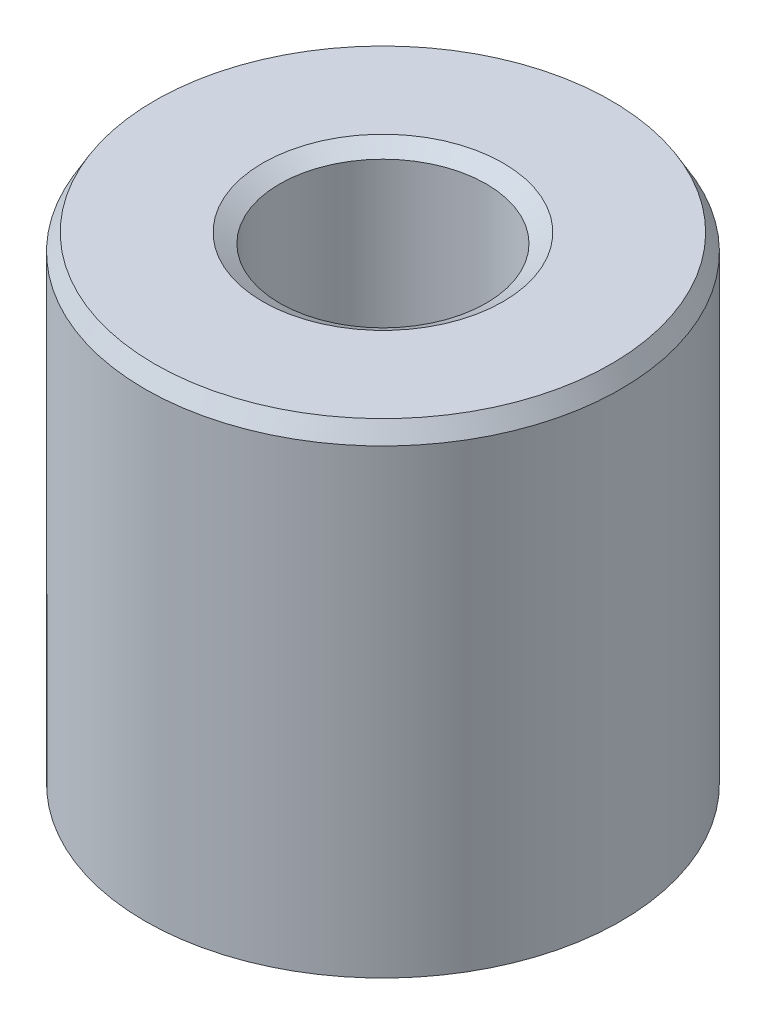
ISO-10303-21;
HEADER;
FILE_DESCRIPTION(('STEP AP214'),'2;1');
FILE_NAME('part.step','',(''),(''),'','','');
FILE_SCHEMA(('AUTOMOTIVE_DESIGN { 1 0 10303 214 1 1 1 1 }'));
ENDSEC;
DATA;
#1=APPLICATION_CONTEXT('core data for automotive mechanical design processes');
#2=APPLICATION_PROTOCOL_DEFINITION('international standard','automotive_design',2000,#1);
#3=PRODUCT_CONTEXT('',#1,'mechanical');
#4=PRODUCT('Part','Part','',(#3));
#5=PRODUCT_RELATED_PRODUCT_CATEGORY('part','',(#4));
#6=PRODUCT_DEFINITION_FORMATION('','',#4);
#7=PRODUCT_DEFINITION_CONTEXT('part definition',#1,'design');
#8=PRODUCT_DEFINITION('design','',#6,#7);
#9=PRODUCT_DEFINITION_SHAPE('','',#8);
#10=(LENGTH_UNIT() NAMED_UNIT(*) SI_UNIT(.MILLI.,.METRE.));
#11=(NAMED_UNIT(*) PLANE_ANGLE_UNIT() SI_UNIT($,.RADIAN.));
#12=(NAMED_UNIT(*) SI_UNIT($,.STERADIAN.) SOLID_ANGLE_UNIT());
#13=UNCERTAINTY_MEASURE_WITH_UNIT(LENGTH_MEASURE(1.E-05),#10,'distance_accuracy_value','');
#14=(GEOMETRIC_REPRESENTATION_CONTEXT(3) GLOBAL_UNCERTAINTY_ASSIGNED_CONTEXT((#13)) GLOBAL_UNIT_ASSIGNED_CONTEXT((#10,
#11,#12)) REPRESENTATION_CONTEXT('',''));
#15=CARTESIAN_POINT('',(0.,0.,0.));
#16=DIRECTION('',(0.,0.,1.));
#17=DIRECTION('',(1.,0.,0.));
#18=AXIS2_PLACEMENT_3D('',#15,#16,#17);
#19=CARTESIAN_POINT('',(0.,66.5699540929479,0.));
#20=DIRECTION('',(0.,-1.,0.));
#21=DIRECTION('',(0.,0.,-1.));
#22=AXIS2_PLACEMENT_3D('',#19,#20,#21);
#23=CYLINDRICAL_SURFACE('',#22,32.5);
#24=CARTESIAN_POINT('',(0.,1.32758882361556,0.));
#25=DIRECTION('',(0.,1.,0.));
#26=DIRECTION('',(0.,0.,1.));
#27=AXIS2_PLACEMENT_3D('',#24,#25,#26);
#28=CIRCLE('',#27,32.5);
#29=CARTESIAN_POINT('',(0.,1.32758882361556,32.5));
#30=VERTEX_POINT('',#29);
#31=EDGE_CURVE('E10',#30,#30,#28,.T.);
#32=ORIENTED_EDGE('',*,*,#31,.T.);
#33=EDGE_LOOP('',(#32));
#34=FACE_BOUND('',#33,.T.);
#35=CARTESIAN_POINT('',(0.,64.2705027988852,0.));
#36=DIRECTION('',(0.,1.,0.));
#37=DIRECTION('',(0.,0.,1.));
#38=AXIS2_PLACEMENT_3D('',#35,#36,#37);
#39=CIRCLE('',#38,32.5);
#40=CARTESIAN_POINT('',(0.,64.2705027988852,32.5));
#41=VERTEX_POINT('',#40);
#42=EDGE_CURVE('E50',#41,#41,#39,.F.);
#43=ORIENTED_EDGE('',*,*,#42,.T.);
#44=EDGE_LOOP('',(#43));
#45=FACE_BOUND('',#44,.T.);
#46=ADVANCED_FACE('F39',(#34,#45),#23,.T.);
#47=CARTESIAN_POINT('',(0.,66.5699540929479,0.));
#48=DIRECTION('',(0.,1.,0.));
#49=DIRECTION('',(0.,0.,1.));
#50=AXIS2_PLACEMENT_3D('',#47,#48,#49);
#51=PLANE('',#50);
#52=CARTESIAN_POINT('',(0.,66.5699540929479,0.));
#53=DIRECTION('',(0.,1.,0.));
#54=DIRECTION('',(0.,0.,1.));
#55=AXIS2_PLACEMENT_3D('',#52,#53,#54);
#56=CIRCLE('',#55,16.4121375367634);
#57=CARTESIAN_POINT('',(0.,66.5699540929479,16.4121375367634));
#58=VERTEX_POINT('',#57);
#59=EDGE_CURVE('E58',#58,#58,#56,.F.);
#60=ORIENTED_EDGE('',*,*,#59,.T.);
#61=EDGE_LOOP('',(#60));
#62=FACE_BOUND('',#61,.T.);
#63=CARTESIAN_POINT('',(0.,66.5699540929479,0.));
#64=DIRECTION('',(0.,1.,0.));
#65=DIRECTION('',(0.,0.,1.));
#66=AXIS2_PLACEMENT_3D('',#63,#64,#65);
#67=CIRCLE('',#66,31.1724111763844);
#68=CARTESIAN_POINT('',(0.,66.5699540929479,31.1724111763844));
#69=VERTEX_POINT('',#68);
#70=EDGE_CURVE('E61',#69,#69,#67,.T.);
#71=ORIENTED_EDGE('',*,*,#70,.T.);
#72=EDGE_LOOP('',(#71));
#73=FACE_BOUND('',#72,.T.);
#74=ADVANCED_FACE('F88',(#62,#73),#51,.T.);
#75=CARTESIAN_POINT('',(0.,0.,0.));
#76=DIRECTION('',(0.,1.,0.));
#77=DIRECTION('',(0.,0.,1.));
#78=AXIS2_PLACEMENT_3D('',#75,#76,#77);
#79=PLANE('',#78);
#80=CARTESIAN_POINT('',(0.,0.,0.));
#81=DIRECTION('',(0.,1.,0.));
#82=DIRECTION('',(0.,0.,1.));
#83=AXIS2_PLACEMENT_3D('',#80,#81,#82);
#84=CIRCLE('',#83,15.4402750663162);
#85=CARTESIAN_POINT('',(0.,0.,15.4402750663162));
#86=VERTEX_POINT('',#85);
#87=EDGE_CURVE('E51',#86,#86,#84,.T.);
#88=ORIENTED_EDGE('',*,*,#87,.T.);
#89=EDGE_LOOP('',(#88));
#90=FACE_BOUND('',#89,.T.);
#91=CARTESIAN_POINT('',(0.,0.,0.));
#92=DIRECTION('',(0.,1.,0.));
#93=DIRECTION('',(0.,0.,1.));
#94=AXIS2_PLACEMENT_3D('',#91,#92,#93);
#95=CIRCLE('',#94,30.2005487059372);
#96=CARTESIAN_POINT('',(0.,0.,30.2005487059372));
#97=VERTEX_POINT('',#96);
#98=EDGE_CURVE('E54',#97,#97,#95,.F.);
#99=ORIENTED_EDGE('',*,*,#98,.T.);
#100=EDGE_LOOP('',(#99));
#101=FACE_BOUND('',#100,.T.);
#102=ADVANCED_FACE('F83',(#90,#101),#79,.F.);
#103=CARTESIAN_POINT('',(0.,66.5699540929479,0.));
#104=DIRECTION('',(0.,-1.,0.));
#105=DIRECTION('',(0.,0.,-1.));
#106=AXIS2_PLACEMENT_3D('',#103,#104,#105);
#107=CYLINDRICAL_SURFACE('',#106,14.1126862427007);
#108=CARTESIAN_POINT('',(0.,65.2423652693324,0.));
#109=DIRECTION('',(0.,1.,0.));
#110=DIRECTION('',(0.,0.,1.));
#111=AXIS2_PLACEMENT_3D('',#108,#109,#110);
#112=CIRCLE('',#111,14.1126862427007);
#113=CARTESIAN_POINT('',(0.,65.2423652693324,14.1126862427007));
#114=VERTEX_POINT('',#113);
#115=EDGE_CURVE('E67',#114,#114,#112,.T.);
#116=ORIENTED_EDGE('',*,*,#115,.T.);
#117=EDGE_LOOP('',(#116));
#118=FACE_BOUND('',#117,.T.);
#119=CARTESIAN_POINT('',(0.,2.29945129406278,0.));
#120=DIRECTION('',(0.,1.,0.));
#121=DIRECTION('',(0.,0.,1.));
#122=AXIS2_PLACEMENT_3D('',#119,#120,#121);
#123=CIRCLE('',#122,14.1126862427007);
#124=CARTESIAN_POINT('',(0.,2.29945129406278,14.1126862427007));
#125=VERTEX_POINT('',#124);
#126=EDGE_CURVE('E69',#125,#125,#123,.F.);
#127=ORIENTED_EDGE('',*,*,#126,.T.);
#128=EDGE_LOOP('',(#127));
#129=FACE_BOUND('',#128,.T.);
#130=ADVANCED_FACE('F71',(#118,#129),#107,.F.);
#131=CARTESIAN_POINT('',(0.,65.2423652693324,0.));
#132=DIRECTION('',(0.,1.,0.));
#133=DIRECTION('',(0.,0.,1.));
#134=AXIS2_PLACEMENT_3D('',#131,#132,#133);
#135=CONICAL_SURFACE('',#134,14.1126862427007,1.0471975511966);
#136=ORIENTED_EDGE('',*,*,#59,.F.);
#137=EDGE_LOOP('',(#136));
#138=FACE_BOUND('',#137,.T.);
#139=ORIENTED_EDGE('',*,*,#115,.F.);
#140=EDGE_LOOP('',(#139));
#141=FACE_BOUND('',#140,.T.);
#142=ADVANCED_FACE('F77',(#138,#141),#135,.F.);
#143=CARTESIAN_POINT('',(0.,0.,0.));
#144=DIRECTION('',(0.,-1.,0.));
#145=DIRECTION('',(0.,0.,-1.));
#146=AXIS2_PLACEMENT_3D('',#143,#144,#145);
#147=CONICAL_SURFACE('',#146,15.4402750663162,0.523598775598294);
#148=ORIENTED_EDGE('',*,*,#126,.F.);
#149=EDGE_LOOP('',(#148));
#150=FACE_BOUND('',#149,.T.);
#151=ORIENTED_EDGE('',*,*,#87,.F.);
#152=EDGE_LOOP('',(#151));
#153=FACE_BOUND('',#152,.T.);
#154=ADVANCED_FACE('F73',(#150,#153),#147,.F.);
#155=CARTESIAN_POINT('',(0.,1.32758882361556,0.));
#156=DIRECTION('',(0.,1.,0.));
#157=DIRECTION('',(0.,0.,1.));
#158=AXIS2_PLACEMENT_3D('',#155,#156,#157);
#159=CONICAL_SURFACE('',#158,32.5,1.04719755119661);
#160=ORIENTED_EDGE('',*,*,#98,.F.);
#161=EDGE_LOOP('',(#160));
#162=FACE_BOUND('',#161,.T.);
#163=ORIENTED_EDGE('',*,*,#31,.F.);
#164=EDGE_LOOP('',(#163));
#165=FACE_BOUND('',#164,.T.);
#166=ADVANCED_FACE('F76',(#162,#165),#159,.T.);
#167=CARTESIAN_POINT('',(0.,66.5699540929479,0.));
#168=DIRECTION('',(0.,-1.,0.));
#169=DIRECTION('',(0.,0.,-1.));
#170=AXIS2_PLACEMENT_3D('',#167,#168,#169);
#171=CONICAL_SURFACE('',#170,31.1724111763844,0.523598775598296);
#172=ORIENTED_EDGE('',*,*,#42,.F.);
#173=EDGE_LOOP('',(#172));
#174=FACE_BOUND('',#173,.T.);
#175=ORIENTED_EDGE('',*,*,#70,.F.);
#176=EDGE_LOOP('',(#175));
#177=FACE_BOUND('',#176,.T.);
#178=ADVANCED_FACE('F45',(#174,#177),#171,.T.);
#179=CLOSED_SHELL('',(#46,#74,#102,#130,#142,#154,#166,#178));
#180=MANIFOLD_SOLID_BREP('B2',#179);
#181=ADVANCED_BREP_SHAPE_REPRESENTATION('',(#18,#180),#14);
#182=SHAPE_DEFINITION_REPRESENTATION(#9,#181);
ENDSEC;
END-ISO-10303-21;
